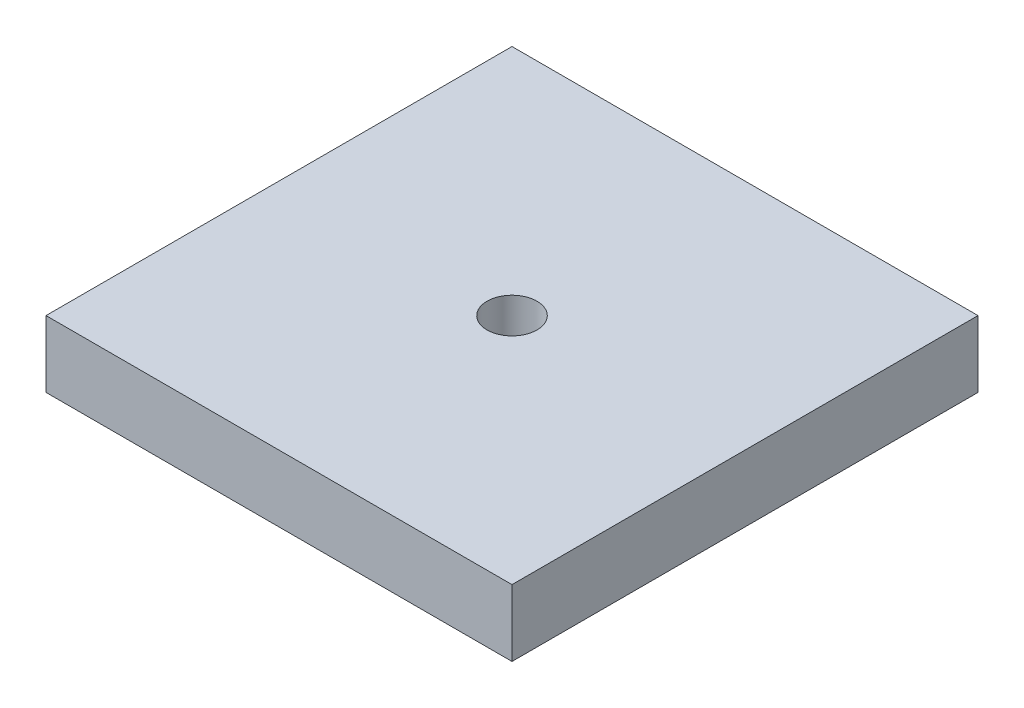
ISO-10303-21;
HEADER;
FILE_DESCRIPTION(('STEP AP214'),'2;1');
FILE_NAME('part.step','',(''),(''),'','','');
FILE_SCHEMA(('AUTOMOTIVE_DESIGN { 1 0 10303 214 1 1 1 1 }'));
ENDSEC;
DATA;
#1=APPLICATION_CONTEXT('core data for automotive mechanical design processes');
#2=APPLICATION_PROTOCOL_DEFINITION('international standard','automotive_design',2000,#1);
#3=PRODUCT_CONTEXT('',#1,'mechanical');
#4=PRODUCT('Part','Part','',(#3));
#5=PRODUCT_RELATED_PRODUCT_CATEGORY('part','',(#4));
#6=PRODUCT_DEFINITION_FORMATION('','',#4);
#7=PRODUCT_DEFINITION_CONTEXT('part definition',#1,'design');
#8=PRODUCT_DEFINITION('design','',#6,#7);
#9=PRODUCT_DEFINITION_SHAPE('','',#8);
#10=(LENGTH_UNIT() NAMED_UNIT(*) SI_UNIT(.MILLI.,.METRE.));
#11=(NAMED_UNIT(*) PLANE_ANGLE_UNIT() SI_UNIT($,.RADIAN.));
#12=(NAMED_UNIT(*) SI_UNIT($,.STERADIAN.) SOLID_ANGLE_UNIT());
#13=UNCERTAINTY_MEASURE_WITH_UNIT(LENGTH_MEASURE(1.E-05),#10,'distance_accuracy_value','');
#14=(GEOMETRIC_REPRESENTATION_CONTEXT(3) GLOBAL_UNCERTAINTY_ASSIGNED_CONTEXT((#13)) GLOBAL_UNIT_ASSIGNED_CONTEXT((#10,
#11,#12)) REPRESENTATION_CONTEXT('',''));
#15=CARTESIAN_POINT('',(0.,0.,0.));
#16=DIRECTION('',(0.,0.,1.));
#17=DIRECTION('',(1.,0.,0.));
#18=AXIS2_PLACEMENT_3D('',#15,#16,#17);
#19=CARTESIAN_POINT('',(0.,1.6,-11.2));
#20=DIRECTION('',(0.,0.,-1.));
#21=DIRECTION('',(-1.,0.,0.));
#22=AXIS2_PLACEMENT_3D('',#19,#20,#21);
#23=PLANE('',#22);
#24=DIRECTION('',(1.,0.,0.));
#25=VECTOR('',#24,1.);
#26=CARTESIAN_POINT('',(0.,0.,-11.2));
#27=LINE('',#26,#25);
#28=CARTESIAN_POINT('',(0.,0.,-11.2));
#29=VERTEX_POINT('',#28);
#30=CARTESIAN_POINT('',(11.2,0.,-11.2));
#31=VERTEX_POINT('',#30);
#32=EDGE_CURVE('E103',#29,#31,#27,.T.);
#33=ORIENTED_EDGE('',*,*,#32,.F.);
#34=DIRECTION('',(0.,-1.,0.));
#35=VECTOR('',#34,1.);
#36=CARTESIAN_POINT('',(0.,1.6,-11.2));
#37=LINE('',#36,#35);
#38=CARTESIAN_POINT('',(0.,1.6,-11.2));
#39=VERTEX_POINT('',#38);
#40=EDGE_CURVE('E11',#39,#29,#37,.T.);
#41=ORIENTED_EDGE('',*,*,#40,.F.);
#42=DIRECTION('',(1.,0.,0.));
#43=VECTOR('',#42,1.);
#44=CARTESIAN_POINT('',(0.,1.6,-11.2));
#45=LINE('',#44,#43);
#46=CARTESIAN_POINT('',(11.2,1.6,-11.2));
#47=VERTEX_POINT('',#46);
#48=EDGE_CURVE('E96',#39,#47,#45,.T.);
#49=ORIENTED_EDGE('',*,*,#48,.T.);
#50=DIRECTION('',(0.,-1.,0.));
#51=VECTOR('',#50,1.);
#52=CARTESIAN_POINT('',(11.2,1.6,-11.2));
#53=LINE('',#52,#51);
#54=EDGE_CURVE('E93',#47,#31,#53,.T.);
#55=ORIENTED_EDGE('',*,*,#54,.T.);
#56=EDGE_LOOP('',(#33,#41,#49,#55));
#57=FACE_BOUND('',#56,.T.);
#58=ADVANCED_FACE('F36',(#57),#23,.T.);
#59=CARTESIAN_POINT('',(0.,1.6,0.));
#60=DIRECTION('',(-1.,0.,0.));
#61=DIRECTION('',(0.,0.,1.));
#62=AXIS2_PLACEMENT_3D('',#59,#60,#61);
#63=PLANE('',#62);
#64=DIRECTION('',(0.,0.,-1.));
#65=VECTOR('',#64,1.);
#66=CARTESIAN_POINT('',(0.,0.,0.));
#67=LINE('',#66,#65);
#68=CARTESIAN_POINT('',(0.,0.,0.));
#69=VERTEX_POINT('',#68);
#70=EDGE_CURVE('E98',#69,#29,#67,.T.);
#71=ORIENTED_EDGE('',*,*,#70,.F.);
#72=DIRECTION('',(0.,-1.,0.));
#73=VECTOR('',#72,1.);
#74=CARTESIAN_POINT('',(0.,1.6,0.));
#75=LINE('',#74,#73);
#76=CARTESIAN_POINT('',(0.,1.6,0.));
#77=VERTEX_POINT('',#76);
#78=EDGE_CURVE('E45',#77,#69,#75,.T.);
#79=ORIENTED_EDGE('',*,*,#78,.F.);
#80=DIRECTION('',(0.,0.,-1.));
#81=VECTOR('',#80,1.);
#82=CARTESIAN_POINT('',(0.,1.6,0.));
#83=LINE('',#82,#81);
#84=EDGE_CURVE('E84',#77,#39,#83,.T.);
#85=ORIENTED_EDGE('',*,*,#84,.T.);
#86=ORIENTED_EDGE('',*,*,#40,.T.);
#87=EDGE_LOOP('',(#71,#79,#85,#86));
#88=FACE_BOUND('',#87,.T.);
#89=ADVANCED_FACE('F113',(#88),#63,.T.);
#90=CARTESIAN_POINT('',(0.,1.6,0.));
#91=DIRECTION('',(0.,0.,-1.));
#92=DIRECTION('',(-1.,0.,0.));
#93=AXIS2_PLACEMENT_3D('',#90,#91,#92);
#94=PLANE('',#93);
#95=DIRECTION('',(1.,0.,0.));
#96=VECTOR('',#95,1.);
#97=CARTESIAN_POINT('',(0.,0.,0.));
#98=LINE('',#97,#96);
#99=CARTESIAN_POINT('',(11.2,0.,0.));
#100=VERTEX_POINT('',#99);
#101=EDGE_CURVE('E89',#69,#100,#98,.T.);
#102=ORIENTED_EDGE('',*,*,#101,.T.);
#103=DIRECTION('',(0.,-1.,0.));
#104=VECTOR('',#103,1.);
#105=CARTESIAN_POINT('',(11.2,1.6,0.));
#106=LINE('',#105,#104);
#107=CARTESIAN_POINT('',(11.2,1.6,0.));
#108=VERTEX_POINT('',#107);
#109=EDGE_CURVE('E87',#108,#100,#106,.T.);
#110=ORIENTED_EDGE('',*,*,#109,.F.);
#111=DIRECTION('',(1.,0.,0.));
#112=VECTOR('',#111,1.);
#113=CARTESIAN_POINT('',(0.,1.6,0.));
#114=LINE('',#113,#112);
#115=EDGE_CURVE('E81',#77,#108,#114,.T.);
#116=ORIENTED_EDGE('',*,*,#115,.F.);
#117=ORIENTED_EDGE('',*,*,#78,.T.);
#118=EDGE_LOOP('',(#102,#110,#116,#117));
#119=FACE_BOUND('',#118,.T.);
#120=ADVANCED_FACE('F88',(#119),#94,.F.);
#121=CARTESIAN_POINT('',(11.2,1.6,0.));
#122=DIRECTION('',(-1.,0.,0.));
#123=DIRECTION('',(0.,0.,1.));
#124=AXIS2_PLACEMENT_3D('',#121,#122,#123);
#125=PLANE('',#124);
#126=DIRECTION('',(0.,0.,-1.));
#127=VECTOR('',#126,1.);
#128=CARTESIAN_POINT('',(11.2,0.,0.));
#129=LINE('',#128,#127);
#130=EDGE_CURVE('E106',#100,#31,#129,.T.);
#131=ORIENTED_EDGE('',*,*,#130,.T.);
#132=ORIENTED_EDGE('',*,*,#54,.F.);
#133=DIRECTION('',(0.,0.,-1.));
#134=VECTOR('',#133,1.);
#135=CARTESIAN_POINT('',(11.2,1.6,0.));
#136=LINE('',#135,#134);
#137=EDGE_CURVE('E78',#108,#47,#136,.T.);
#138=ORIENTED_EDGE('',*,*,#137,.F.);
#139=ORIENTED_EDGE('',*,*,#109,.T.);
#140=EDGE_LOOP('',(#131,#132,#138,#139));
#141=FACE_BOUND('',#140,.T.);
#142=ADVANCED_FACE('F95',(#141),#125,.F.);
#143=CARTESIAN_POINT('',(0.,1.6,0.));
#144=DIRECTION('',(0.,1.,0.));
#145=DIRECTION('',(0.,0.,1.));
#146=AXIS2_PLACEMENT_3D('',#143,#144,#145);
#147=PLANE('',#146);
#148=CARTESIAN_POINT('',(5.6,1.6,-5.6));
#149=DIRECTION('',(0.,1.,0.));
#150=DIRECTION('',(0.,0.,1.));
#151=AXIS2_PLACEMENT_3D('',#148,#149,#150);
#152=CIRCLE('',#151,0.6);
#153=CARTESIAN_POINT('',(5.6,1.6,-5.));
#154=VERTEX_POINT('',#153);
#155=EDGE_CURVE('E141',#154,#154,#152,.T.);
#156=ORIENTED_EDGE('',*,*,#155,.F.);
#157=EDGE_LOOP('',(#156));
#158=FACE_BOUND('',#157,.T.);
#159=ORIENTED_EDGE('',*,*,#48,.F.);
#160=ORIENTED_EDGE('',*,*,#84,.F.);
#161=ORIENTED_EDGE('',*,*,#115,.T.);
#162=ORIENTED_EDGE('',*,*,#137,.T.);
#163=EDGE_LOOP('',(#159,#160,#161,#162));
#164=FACE_BOUND('',#163,.T.);
#165=ADVANCED_FACE('F83',(#158,#164),#147,.T.);
#166=CARTESIAN_POINT('',(0.,0.,0.));
#167=DIRECTION('',(0.,1.,0.));
#168=DIRECTION('',(0.,0.,1.));
#169=AXIS2_PLACEMENT_3D('',#166,#167,#168);
#170=PLANE('',#169);
#171=CARTESIAN_POINT('',(5.6,0.,-5.6));
#172=DIRECTION('',(0.,1.,0.));
#173=DIRECTION('',(0.,0.,1.));
#174=AXIS2_PLACEMENT_3D('',#171,#172,#173);
#175=CIRCLE('',#174,0.6);
#176=CARTESIAN_POINT('',(5.6,0.,-5.));
#177=VERTEX_POINT('',#176);
#178=EDGE_CURVE('E39',#177,#177,#175,.T.);
#179=ORIENTED_EDGE('',*,*,#178,.T.);
#180=EDGE_LOOP('',(#179));
#181=FACE_BOUND('',#180,.T.);
#182=ORIENTED_EDGE('',*,*,#32,.T.);
#183=ORIENTED_EDGE('',*,*,#130,.F.);
#184=ORIENTED_EDGE('',*,*,#101,.F.);
#185=ORIENTED_EDGE('',*,*,#70,.T.);
#186=EDGE_LOOP('',(#182,#183,#184,#185));
#187=FACE_BOUND('',#186,.T.);
#188=ADVANCED_FACE('F112',(#181,#187),#170,.F.);
#189=CARTESIAN_POINT('',(5.6,-3.4,-5.6));
#190=DIRECTION('',(0.,1.,0.));
#191=DIRECTION('',(0.,0.,1.));
#192=AXIS2_PLACEMENT_3D('',#189,#190,#191);
#193=CYLINDRICAL_SURFACE('',#192,0.6);
#194=ORIENTED_EDGE('',*,*,#155,.T.);
#195=EDGE_LOOP('',(#194));
#196=FACE_BOUND('',#195,.T.);
#197=ORIENTED_EDGE('',*,*,#178,.F.);
#198=EDGE_LOOP('',(#197));
#199=FACE_BOUND('',#198,.T.);
#200=ADVANCED_FACE('F131',(#196,#199),#193,.F.);
#201=CLOSED_SHELL('',(#58,#89,#120,#142,#165,#188,#200));
#202=MANIFOLD_SOLID_BREP('B2',#201);
#203=ADVANCED_BREP_SHAPE_REPRESENTATION('',(#18,#202),#14);
#204=SHAPE_DEFINITION_REPRESENTATION(#9,#203);
ENDSEC;
END-ISO-10303-21;
